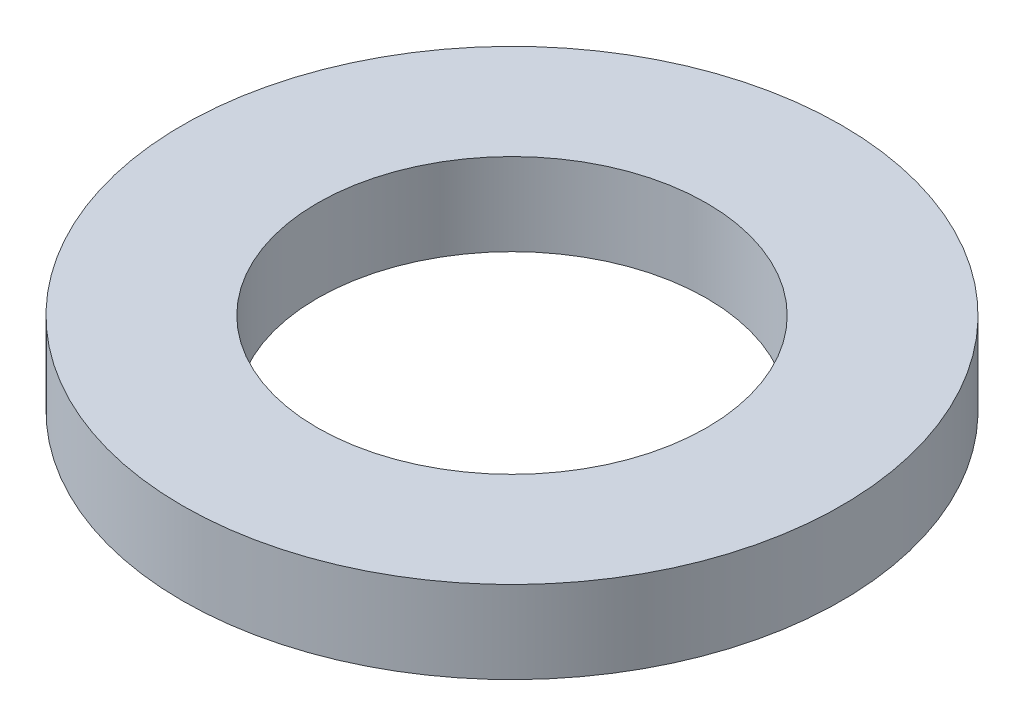
ISO-10303-21;
HEADER;
FILE_DESCRIPTION(('STEP AP214'),'2;1');
FILE_NAME('part.step','',(''),(''),'','','');
FILE_SCHEMA(('AUTOMOTIVE_DESIGN { 1 0 10303 214 1 1 1 1 }'));
ENDSEC;
DATA;
#1=APPLICATION_CONTEXT('core data for automotive mechanical design processes');
#2=APPLICATION_PROTOCOL_DEFINITION('international standard','automotive_design',2000,#1);
#3=PRODUCT_CONTEXT('',#1,'mechanical');
#4=PRODUCT('Part','Part','',(#3));
#5=PRODUCT_RELATED_PRODUCT_CATEGORY('part','',(#4));
#6=PRODUCT_DEFINITION_FORMATION('','',#4);
#7=PRODUCT_DEFINITION_CONTEXT('part definition',#1,'design');
#8=PRODUCT_DEFINITION('design','',#6,#7);
#9=PRODUCT_DEFINITION_SHAPE('','',#8);
#10=(LENGTH_UNIT() NAMED_UNIT(*) SI_UNIT(.MILLI.,.METRE.));
#11=(NAMED_UNIT(*) PLANE_ANGLE_UNIT() SI_UNIT($,.RADIAN.));
#12=(NAMED_UNIT(*) SI_UNIT($,.STERADIAN.) SOLID_ANGLE_UNIT());
#13=UNCERTAINTY_MEASURE_WITH_UNIT(LENGTH_MEASURE(1.E-05),#10,'distance_accuracy_value','');
#14=(GEOMETRIC_REPRESENTATION_CONTEXT(3) GLOBAL_UNCERTAINTY_ASSIGNED_CONTEXT((#13)) GLOBAL_UNIT_ASSIGNED_CONTEXT((#10,
#11,#12)) REPRESENTATION_CONTEXT('',''));
#15=CARTESIAN_POINT('',(0.,0.,0.));
#16=DIRECTION('',(0.,0.,1.));
#17=DIRECTION('',(1.,0.,0.));
#18=AXIS2_PLACEMENT_3D('',#15,#16,#17);
#19=CARTESIAN_POINT('',(0.,1.5875,0.));
#20=DIRECTION('',(0.,1.,0.));
#21=DIRECTION('',(0.,0.,1.));
#22=AXIS2_PLACEMENT_3D('',#19,#20,#21);
#23=PLANE('',#22);
#24=CARTESIAN_POINT('',(0.,1.5875,0.));
#25=DIRECTION('',(0.,1.,0.));
#26=DIRECTION('',(0.,0.,1.));
#27=AXIS2_PLACEMENT_3D('',#24,#25,#26);
#28=CIRCLE('',#27,6.35);
#29=CARTESIAN_POINT('',(0.,1.5875,6.35));
#30=VERTEX_POINT('',#29);
#31=EDGE_CURVE('E10',#30,#30,#28,.T.);
#32=ORIENTED_EDGE('',*,*,#31,.T.);
#33=EDGE_LOOP('',(#32));
#34=FACE_BOUND('',#33,.T.);
#35=CARTESIAN_POINT('',(0.,1.5875,0.));
#36=DIRECTION('',(0.,1.,0.));
#37=DIRECTION('',(0.,0.,1.));
#38=AXIS2_PLACEMENT_3D('',#35,#36,#37);
#39=CIRCLE('',#38,3.75);
#40=CARTESIAN_POINT('',(0.,1.5875,3.75));
#41=VERTEX_POINT('',#40);
#42=EDGE_CURVE('E25',#41,#41,#39,.T.);
#43=ORIENTED_EDGE('',*,*,#42,.F.);
#44=EDGE_LOOP('',(#43));
#45=FACE_BOUND('',#44,.T.);
#46=ADVANCED_FACE('F14',(#34,#45),#23,.T.);
#47=CARTESIAN_POINT('',(0.,0.,0.));
#48=DIRECTION('',(0.,1.,0.));
#49=DIRECTION('',(0.,0.,1.));
#50=AXIS2_PLACEMENT_3D('',#47,#48,#49);
#51=PLANE('',#50);
#52=CARTESIAN_POINT('',(0.,0.,0.));
#53=DIRECTION('',(0.,1.,0.));
#54=DIRECTION('',(0.,0.,1.));
#55=AXIS2_PLACEMENT_3D('',#52,#53,#54);
#56=CIRCLE('',#55,6.35);
#57=CARTESIAN_POINT('',(0.,0.,6.35));
#58=VERTEX_POINT('',#57);
#59=EDGE_CURVE('E18',#58,#58,#56,.T.);
#60=ORIENTED_EDGE('',*,*,#59,.F.);
#61=EDGE_LOOP('',(#60));
#62=FACE_BOUND('',#61,.T.);
#63=CARTESIAN_POINT('',(0.,0.,0.));
#64=DIRECTION('',(0.,1.,0.));
#65=DIRECTION('',(0.,0.,1.));
#66=AXIS2_PLACEMENT_3D('',#63,#64,#65);
#67=CIRCLE('',#66,3.75);
#68=CARTESIAN_POINT('',(0.,0.,3.75));
#69=VERTEX_POINT('',#68);
#70=EDGE_CURVE('E27',#69,#69,#67,.T.);
#71=ORIENTED_EDGE('',*,*,#70,.T.);
#72=EDGE_LOOP('',(#71));
#73=FACE_BOUND('',#72,.T.);
#74=ADVANCED_FACE('F37',(#62,#73),#51,.F.);
#75=CARTESIAN_POINT('',(0.,1.5875,0.));
#76=DIRECTION('',(0.,-1.,0.));
#77=DIRECTION('',(0.,0.,-1.));
#78=AXIS2_PLACEMENT_3D('',#75,#76,#77);
#79=CYLINDRICAL_SURFACE('',#78,6.35);
#80=ORIENTED_EDGE('',*,*,#31,.F.);
#81=EDGE_LOOP('',(#80));
#82=FACE_BOUND('',#81,.T.);
#83=ORIENTED_EDGE('',*,*,#59,.T.);
#84=EDGE_LOOP('',(#83));
#85=FACE_BOUND('',#84,.T.);
#86=ADVANCED_FACE('F16',(#82,#85),#79,.T.);
#87=CARTESIAN_POINT('',(0.,1.5875,0.));
#88=DIRECTION('',(0.,-1.,0.));
#89=DIRECTION('',(0.,0.,-1.));
#90=AXIS2_PLACEMENT_3D('',#87,#88,#89);
#91=CYLINDRICAL_SURFACE('',#90,3.75);
#92=ORIENTED_EDGE('',*,*,#42,.T.);
#93=EDGE_LOOP('',(#92));
#94=FACE_BOUND('',#93,.T.);
#95=ORIENTED_EDGE('',*,*,#70,.F.);
#96=EDGE_LOOP('',(#95));
#97=FACE_BOUND('',#96,.T.);
#98=ADVANCED_FACE('F33',(#94,#97),#91,.F.);
#99=CLOSED_SHELL('',(#46,#74,#86,#98));
#100=MANIFOLD_SOLID_BREP('B1',#99);
#101=ADVANCED_BREP_SHAPE_REPRESENTATION('',(#18,#100),#14);
#102=SHAPE_DEFINITION_REPRESENTATION(#9,#101);
ENDSEC;
END-ISO-10303-21;
